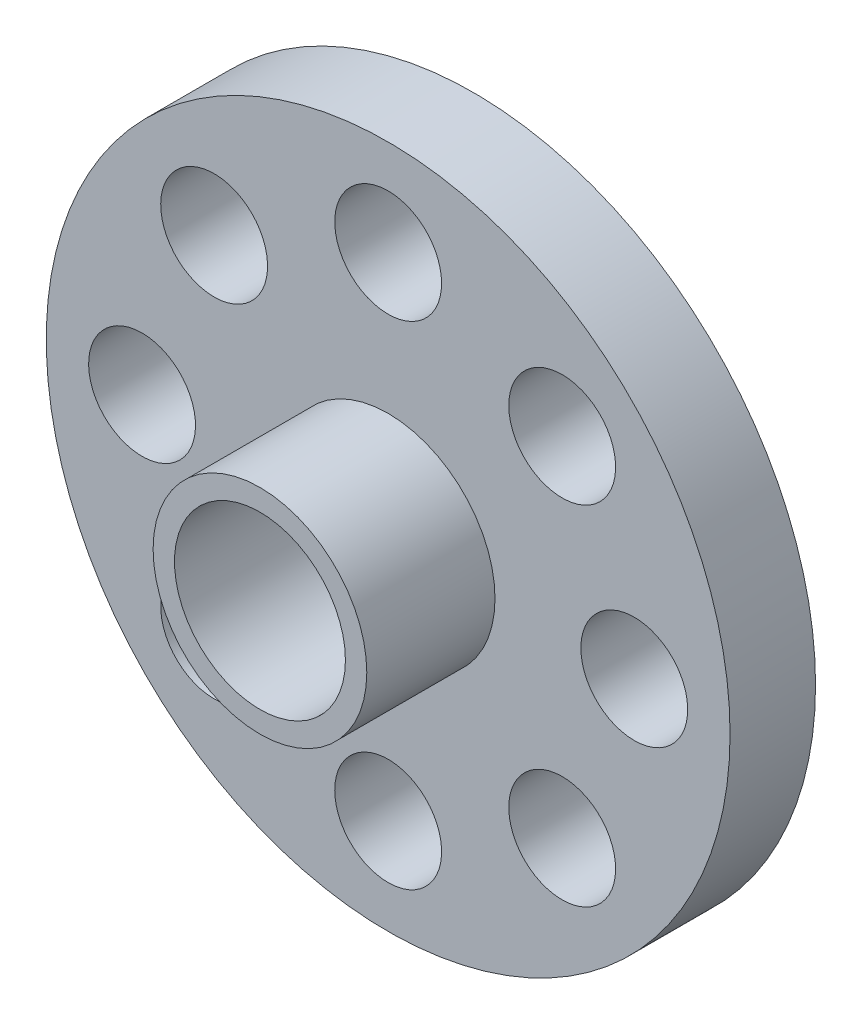
ISO-10303-21;
HEADER;
FILE_DESCRIPTION(('STEP AP214'),'2;1');
FILE_NAME('part.step','',(''),(''),'','','');
FILE_SCHEMA(('AUTOMOTIVE_DESIGN { 1 0 10303 214 1 1 1 1 }'));
ENDSEC;
DATA;
#1=APPLICATION_CONTEXT('core data for automotive mechanical design processes');
#2=APPLICATION_PROTOCOL_DEFINITION('international standard','automotive_design',2000,#1);
#3=PRODUCT_CONTEXT('',#1,'mechanical');
#4=PRODUCT('Part','Part','',(#3));
#5=PRODUCT_RELATED_PRODUCT_CATEGORY('part','',(#4));
#6=PRODUCT_DEFINITION_FORMATION('','',#4);
#7=PRODUCT_DEFINITION_CONTEXT('part definition',#1,'design');
#8=PRODUCT_DEFINITION('design','',#6,#7);
#9=PRODUCT_DEFINITION_SHAPE('','',#8);
#10=(LENGTH_UNIT() NAMED_UNIT(*) SI_UNIT(.MILLI.,.METRE.));
#11=(NAMED_UNIT(*) PLANE_ANGLE_UNIT() SI_UNIT($,.RADIAN.));
#12=(NAMED_UNIT(*) SI_UNIT($,.STERADIAN.) SOLID_ANGLE_UNIT());
#13=UNCERTAINTY_MEASURE_WITH_UNIT(LENGTH_MEASURE(1.E-05),#10,'distance_accuracy_value','');
#14=(GEOMETRIC_REPRESENTATION_CONTEXT(3) GLOBAL_UNCERTAINTY_ASSIGNED_CONTEXT((#13)) GLOBAL_UNIT_ASSIGNED_CONTEXT((#10,
#11,#12)) REPRESENTATION_CONTEXT('',''));
#15=CARTESIAN_POINT('',(0.,0.,0.));
#16=DIRECTION('',(0.,0.,1.));
#17=DIRECTION('',(1.,0.,0.));
#18=AXIS2_PLACEMENT_3D('',#15,#16,#17);
#19=CARTESIAN_POINT('',(0.,0.,10.));
#20=DIRECTION('',(0.,0.,1.));
#21=DIRECTION('',(1.,0.,0.));
#22=AXIS2_PLACEMENT_3D('',#19,#20,#21);
#23=PLANE('',#22);
#24=CARTESIAN_POINT('',(0.,0.,10.));
#25=DIRECTION('',(0.,0.,1.));
#26=DIRECTION('',(1.,0.,0.));
#27=AXIS2_PLACEMENT_3D('',#24,#25,#26);
#28=CIRCLE('',#27,4.);
#29=CARTESIAN_POINT('',(4.,0.,10.));
#30=VERTEX_POINT('',#29);
#31=EDGE_CURVE('E40',#30,#30,#28,.T.);
#32=ORIENTED_EDGE('',*,*,#31,.F.);
#33=EDGE_LOOP('',(#32));
#34=FACE_BOUND('',#33,.T.);
#35=CARTESIAN_POINT('',(0.,0.,10.));
#36=DIRECTION('',(0.,0.,1.));
#37=DIRECTION('',(1.,0.,0.));
#38=AXIS2_PLACEMENT_3D('',#35,#36,#37);
#39=CIRCLE('',#38,5.);
#40=CARTESIAN_POINT('',(5.,0.,10.));
#41=VERTEX_POINT('',#40);
#42=EDGE_CURVE('E54',#41,#41,#39,.T.);
#43=ORIENTED_EDGE('',*,*,#42,.T.);
#44=EDGE_LOOP('',(#43));
#45=FACE_BOUND('',#44,.T.);
#46=ADVANCED_FACE('F33',(#34,#45),#23,.T.);
#47=CARTESIAN_POINT('',(0.,0.,10.));
#48=DIRECTION('',(0.,0.,-1.));
#49=DIRECTION('',(-1.,0.,0.));
#50=AXIS2_PLACEMENT_3D('',#47,#48,#49);
#51=CYLINDRICAL_SURFACE('',#50,16.);
#52=CARTESIAN_POINT('',(0.,0.,0.));
#53=DIRECTION('',(0.,0.,1.));
#54=DIRECTION('',(1.,0.,0.));
#55=AXIS2_PLACEMENT_3D('',#52,#53,#54);
#56=CIRCLE('',#55,16.);
#57=CARTESIAN_POINT('',(16.,0.,0.));
#58=VERTEX_POINT('',#57);
#59=EDGE_CURVE('E10',#58,#58,#56,.T.);
#60=ORIENTED_EDGE('',*,*,#59,.T.);
#61=EDGE_LOOP('',(#60));
#62=FACE_BOUND('',#61,.T.);
#63=CARTESIAN_POINT('',(0.,0.,4.));
#64=DIRECTION('',(0.,0.,1.));
#65=DIRECTION('',(1.,0.,0.));
#66=AXIS2_PLACEMENT_3D('',#63,#64,#65);
#67=CIRCLE('',#66,16.);
#68=CARTESIAN_POINT('',(16.,0.,4.));
#69=VERTEX_POINT('',#68);
#70=EDGE_CURVE('E49',#69,#69,#67,.T.);
#71=ORIENTED_EDGE('',*,*,#70,.F.);
#72=EDGE_LOOP('',(#71));
#73=FACE_BOUND('',#72,.T.);
#74=ADVANCED_FACE('F35',(#62,#73),#51,.T.);
#75=CARTESIAN_POINT('',(0.,0.,0.));
#76=DIRECTION('',(0.,0.,1.));
#77=DIRECTION('',(1.,0.,0.));
#78=AXIS2_PLACEMENT_3D('',#75,#76,#77);
#79=PLANE('',#78);
#80=CARTESIAN_POINT('',(-8.14364214170185,8.14364214170205,0.));
#81=DIRECTION('',(0.,0.,1.));
#82=DIRECTION('',(0.707106781186556,0.707106781186539,0.));
#83=AXIS2_PLACEMENT_3D('',#80,#81,#82);
#84=CIRCLE('',#83,2.5);
#85=CARTESIAN_POINT('',(-6.37587518873546,9.9114090946684,0.));
#86=VERTEX_POINT('',#85);
#87=EDGE_CURVE('E104',#86,#86,#84,.T.);
#88=ORIENTED_EDGE('',*,*,#87,.T.);
#89=EDGE_LOOP('',(#88));
#90=FACE_BOUND('',#89,.T.);
#91=CARTESIAN_POINT('',(-11.516849163908,1.20632591814168E-13,0.));
#92=DIRECTION('',(0.,0.,1.));
#93=DIRECTION('',(0.,1.,0.));
#94=AXIS2_PLACEMENT_3D('',#91,#92,#93);
#95=CIRCLE('',#94,2.5);
#96=CARTESIAN_POINT('',(-11.516849163908,2.50000000000012,0.));
#97=VERTEX_POINT('',#96);
#98=EDGE_CURVE('E98',#97,#97,#95,.T.);
#99=ORIENTED_EDGE('',*,*,#98,.T.);
#100=EDGE_LOOP('',(#99));
#101=FACE_BOUND('',#100,.T.);
#102=CARTESIAN_POINT('',(-8.14364214170202,-8.14364214170188,0.));
#103=DIRECTION('',(0.,0.,1.));
#104=DIRECTION('',(-0.707106781186541,0.707106781186554,0.));
#105=AXIS2_PLACEMENT_3D('',#102,#103,#104);
#106=CIRCLE('',#105,2.5);
#107=CARTESIAN_POINT('',(-9.91140909466838,-6.3758751887355,0.));
#108=VERTEX_POINT('',#107);
#109=EDGE_CURVE('E92',#108,#108,#106,.T.);
#110=ORIENTED_EDGE('',*,*,#109,.T.);
#111=EDGE_LOOP('',(#110));
#112=FACE_BOUND('',#111,.T.);
#113=CARTESIAN_POINT('',(0.,-11.516849163908,0.));
#114=DIRECTION('',(0.,0.,1.));
#115=DIRECTION('',(-1.,0.,0.));
#116=AXIS2_PLACEMENT_3D('',#113,#114,#115);
#117=CIRCLE('',#116,2.5);
#118=CARTESIAN_POINT('',(-2.5,-11.516849163908,0.));
#119=VERTEX_POINT('',#118);
#120=EDGE_CURVE('E86',#119,#119,#117,.T.);
#121=ORIENTED_EDGE('',*,*,#120,.T.);
#122=EDGE_LOOP('',(#121));
#123=FACE_BOUND('',#122,.T.);
#124=CARTESIAN_POINT('',(8.14364214170191,-8.143642141702,0.));
#125=DIRECTION('',(0.,0.,1.));
#126=DIRECTION('',(-0.707106781186551,-0.707106781186544,0.));
#127=AXIS2_PLACEMENT_3D('',#124,#125,#126);
#128=CIRCLE('',#127,2.5);
#129=CARTESIAN_POINT('',(6.37587518873553,-9.91140909466836,0.));
#130=VERTEX_POINT('',#129);
#131=EDGE_CURVE('E80',#130,#130,#128,.T.);
#132=ORIENTED_EDGE('',*,*,#131,.T.);
#133=EDGE_LOOP('',(#132));
#134=FACE_BOUND('',#133,.T.);
#135=CARTESIAN_POINT('',(11.516849163908,0.,0.));
#136=DIRECTION('',(0.,0.,1.));
#137=DIRECTION('',(0.,-1.,0.));
#138=AXIS2_PLACEMENT_3D('',#135,#136,#137);
#139=CIRCLE('',#138,2.5);
#140=CARTESIAN_POINT('',(11.516849163908,-2.50000000000004,0.));
#141=VERTEX_POINT('',#140);
#142=EDGE_CURVE('E74',#141,#141,#139,.T.);
#143=ORIENTED_EDGE('',*,*,#142,.T.);
#144=EDGE_LOOP('',(#143));
#145=FACE_BOUND('',#144,.T.);
#146=CARTESIAN_POINT('',(8.14364214170197,8.14364214170194,0.));
#147=DIRECTION('',(0.,0.,1.));
#148=DIRECTION('',(0.707106781186546,-0.707106781186549,0.));
#149=AXIS2_PLACEMENT_3D('',#146,#147,#148);
#150=CIRCLE('',#149,2.5);
#151=CARTESIAN_POINT('',(9.91140909466833,6.37587518873557,0.));
#152=VERTEX_POINT('',#151);
#153=EDGE_CURVE('E68',#152,#152,#150,.T.);
#154=ORIENTED_EDGE('',*,*,#153,.T.);
#155=EDGE_LOOP('',(#154));
#156=FACE_BOUND('',#155,.T.);
#157=CARTESIAN_POINT('',(0.,11.516849163908,0.));
#158=DIRECTION('',(0.,0.,1.));
#159=DIRECTION('',(1.,0.,0.));
#160=AXIS2_PLACEMENT_3D('',#157,#158,#159);
#161=CIRCLE('',#160,2.5);
#162=CARTESIAN_POINT('',(2.5,11.516849163908,0.));
#163=VERTEX_POINT('',#162);
#164=EDGE_CURVE('E57',#163,#163,#161,.T.);
#165=ORIENTED_EDGE('',*,*,#164,.T.);
#166=EDGE_LOOP('',(#165));
#167=FACE_BOUND('',#166,.T.);
#168=ORIENTED_EDGE('',*,*,#59,.F.);
#169=EDGE_LOOP('',(#168));
#170=FACE_BOUND('',#169,.T.);
#171=CARTESIAN_POINT('',(0.,0.,0.));
#172=DIRECTION('',(0.,0.,1.));
#173=DIRECTION('',(1.,0.,0.));
#174=AXIS2_PLACEMENT_3D('',#171,#172,#173);
#175=CIRCLE('',#174,4.);
#176=CARTESIAN_POINT('',(4.,0.,0.));
#177=VERTEX_POINT('',#176);
#178=EDGE_CURVE('E44',#177,#177,#175,.T.);
#179=ORIENTED_EDGE('',*,*,#178,.T.);
#180=EDGE_LOOP('',(#179));
#181=FACE_BOUND('',#180,.T.);
#182=ADVANCED_FACE('F108',(#90,#101,#112,#123,#134,#145,#156,#167,#170,#181),#79,.F.);
#183=CARTESIAN_POINT('',(0.,0.,10.));
#184=DIRECTION('',(0.,0.,-1.));
#185=DIRECTION('',(-1.,0.,0.));
#186=AXIS2_PLACEMENT_3D('',#183,#184,#185);
#187=CYLINDRICAL_SURFACE('',#186,4.);
#188=ORIENTED_EDGE('',*,*,#31,.T.);
#189=EDGE_LOOP('',(#188));
#190=FACE_BOUND('',#189,.T.);
#191=ORIENTED_EDGE('',*,*,#178,.F.);
#192=EDGE_LOOP('',(#191));
#193=FACE_BOUND('',#192,.T.);
#194=ADVANCED_FACE('F122',(#190,#193),#187,.F.);
#195=CARTESIAN_POINT('',(0.,0.,4.));
#196=DIRECTION('',(0.,0.,1.));
#197=DIRECTION('',(1.,0.,0.));
#198=AXIS2_PLACEMENT_3D('',#195,#196,#197);
#199=PLANE('',#198);
#200=CARTESIAN_POINT('',(-8.14364214170185,8.14364214170205,4.));
#201=DIRECTION('',(0.,0.,1.));
#202=DIRECTION('',(0.707106781186556,0.707106781186539,0.));
#203=AXIS2_PLACEMENT_3D('',#200,#201,#202);
#204=CIRCLE('',#203,2.5);
#205=CARTESIAN_POINT('',(-6.37587518873546,9.9114090946684,4.));
#206=VERTEX_POINT('',#205);
#207=EDGE_CURVE('E101',#206,#206,#204,.T.);
#208=ORIENTED_EDGE('',*,*,#207,.F.);
#209=EDGE_LOOP('',(#208));
#210=FACE_BOUND('',#209,.T.);
#211=CARTESIAN_POINT('',(-11.516849163908,1.20632591814168E-13,4.));
#212=DIRECTION('',(0.,0.,1.));
#213=DIRECTION('',(0.,1.,0.));
#214=AXIS2_PLACEMENT_3D('',#211,#212,#213);
#215=CIRCLE('',#214,2.5);
#216=CARTESIAN_POINT('',(-11.516849163908,2.50000000000012,4.));
#217=VERTEX_POINT('',#216);
#218=EDGE_CURVE('E95',#217,#217,#215,.T.);
#219=ORIENTED_EDGE('',*,*,#218,.F.);
#220=EDGE_LOOP('',(#219));
#221=FACE_BOUND('',#220,.T.);
#222=CARTESIAN_POINT('',(-8.14364214170202,-8.14364214170188,4.));
#223=DIRECTION('',(0.,0.,1.));
#224=DIRECTION('',(-0.707106781186541,0.707106781186554,0.));
#225=AXIS2_PLACEMENT_3D('',#222,#223,#224);
#226=CIRCLE('',#225,2.5);
#227=CARTESIAN_POINT('',(-9.91140909466838,-6.3758751887355,4.));
#228=VERTEX_POINT('',#227);
#229=EDGE_CURVE('E89',#228,#228,#226,.T.);
#230=ORIENTED_EDGE('',*,*,#229,.F.);
#231=EDGE_LOOP('',(#230));
#232=FACE_BOUND('',#231,.T.);
#233=CARTESIAN_POINT('',(0.,-11.516849163908,4.));
#234=DIRECTION('',(0.,0.,1.));
#235=DIRECTION('',(-1.,0.,0.));
#236=AXIS2_PLACEMENT_3D('',#233,#234,#235);
#237=CIRCLE('',#236,2.5);
#238=CARTESIAN_POINT('',(-2.5,-11.516849163908,4.));
#239=VERTEX_POINT('',#238);
#240=EDGE_CURVE('E83',#239,#239,#237,.T.);
#241=ORIENTED_EDGE('',*,*,#240,.F.);
#242=EDGE_LOOP('',(#241));
#243=FACE_BOUND('',#242,.T.);
#244=CARTESIAN_POINT('',(8.14364214170191,-8.143642141702,4.));
#245=DIRECTION('',(0.,0.,1.));
#246=DIRECTION('',(-0.707106781186551,-0.707106781186544,0.));
#247=AXIS2_PLACEMENT_3D('',#244,#245,#246);
#248=CIRCLE('',#247,2.5);
#249=CARTESIAN_POINT('',(6.37587518873553,-9.91140909466836,4.));
#250=VERTEX_POINT('',#249);
#251=EDGE_CURVE('E77',#250,#250,#248,.T.);
#252=ORIENTED_EDGE('',*,*,#251,.F.);
#253=EDGE_LOOP('',(#252));
#254=FACE_BOUND('',#253,.T.);
#255=CARTESIAN_POINT('',(11.516849163908,0.,4.));
#256=DIRECTION('',(0.,0.,1.));
#257=DIRECTION('',(0.,-1.,0.));
#258=AXIS2_PLACEMENT_3D('',#255,#256,#257);
#259=CIRCLE('',#258,2.5);
#260=CARTESIAN_POINT('',(11.516849163908,-2.50000000000004,4.));
#261=VERTEX_POINT('',#260);
#262=EDGE_CURVE('E71',#261,#261,#259,.T.);
#263=ORIENTED_EDGE('',*,*,#262,.F.);
#264=EDGE_LOOP('',(#263));
#265=FACE_BOUND('',#264,.T.);
#266=CARTESIAN_POINT('',(8.14364214170197,8.14364214170194,4.));
#267=DIRECTION('',(0.,0.,1.));
#268=DIRECTION('',(0.707106781186546,-0.707106781186549,0.));
#269=AXIS2_PLACEMENT_3D('',#266,#267,#268);
#270=CIRCLE('',#269,2.5);
#271=CARTESIAN_POINT('',(9.91140909466833,6.37587518873557,4.));
#272=VERTEX_POINT('',#271);
#273=EDGE_CURVE('E63',#272,#272,#270,.T.);
#274=ORIENTED_EDGE('',*,*,#273,.F.);
#275=EDGE_LOOP('',(#274));
#276=FACE_BOUND('',#275,.T.);
#277=CARTESIAN_POINT('',(0.,11.516849163908,4.));
#278=DIRECTION('',(0.,0.,1.));
#279=DIRECTION('',(1.,0.,0.));
#280=AXIS2_PLACEMENT_3D('',#277,#278,#279);
#281=CIRCLE('',#280,2.5);
#282=CARTESIAN_POINT('',(2.5,11.516849163908,4.));
#283=VERTEX_POINT('',#282);
#284=EDGE_CURVE('E60',#283,#283,#281,.T.);
#285=ORIENTED_EDGE('',*,*,#284,.F.);
#286=EDGE_LOOP('',(#285));
#287=FACE_BOUND('',#286,.T.);
#288=CARTESIAN_POINT('',(0.,0.,4.));
#289=DIRECTION('',(0.,0.,1.));
#290=DIRECTION('',(1.,0.,0.));
#291=AXIS2_PLACEMENT_3D('',#288,#289,#290);
#292=CIRCLE('',#291,5.);
#293=CARTESIAN_POINT('',(5.,0.,4.));
#294=VERTEX_POINT('',#293);
#295=EDGE_CURVE('E53',#294,#294,#292,.T.);
#296=ORIENTED_EDGE('',*,*,#295,.F.);
#297=EDGE_LOOP('',(#296));
#298=FACE_BOUND('',#297,.T.);
#299=ORIENTED_EDGE('',*,*,#70,.T.);
#300=EDGE_LOOP('',(#299));
#301=FACE_BOUND('',#300,.T.);
#302=ADVANCED_FACE('F118',(#210,#221,#232,#243,#254,#265,#276,#287,#298,#301),#199,.T.);
#303=CARTESIAN_POINT('',(0.,0.,4.));
#304=DIRECTION('',(0.,0.,1.));
#305=DIRECTION('',(1.,0.,0.));
#306=AXIS2_PLACEMENT_3D('',#303,#304,#305);
#307=CYLINDRICAL_SURFACE('',#306,5.);
#308=ORIENTED_EDGE('',*,*,#295,.T.);
#309=EDGE_LOOP('',(#308));
#310=FACE_BOUND('',#309,.T.);
#311=ORIENTED_EDGE('',*,*,#42,.F.);
#312=EDGE_LOOP('',(#311));
#313=FACE_BOUND('',#312,.T.);
#314=ADVANCED_FACE('F121',(#310,#313),#307,.T.);
#315=CARTESIAN_POINT('',(0.,11.516849163908,0.));
#316=DIRECTION('',(0.,0.,1.));
#317=DIRECTION('',(1.,0.,0.));
#318=AXIS2_PLACEMENT_3D('',#315,#316,#317);
#319=CYLINDRICAL_SURFACE('',#318,2.5);
#320=ORIENTED_EDGE('',*,*,#164,.F.);
#321=EDGE_LOOP('',(#320));
#322=FACE_BOUND('',#321,.T.);
#323=ORIENTED_EDGE('',*,*,#284,.T.);
#324=EDGE_LOOP('',(#323));
#325=FACE_BOUND('',#324,.T.);
#326=ADVANCED_FACE('F157',(#322,#325),#319,.F.);
#327=CARTESIAN_POINT('',(8.14364214170197,8.14364214170194,0.));
#328=DIRECTION('',(0.,0.,1.));
#329=DIRECTION('',(0.707106781186546,-0.707106781186549,0.));
#330=AXIS2_PLACEMENT_3D('',#327,#328,#329);
#331=CYLINDRICAL_SURFACE('',#330,2.5);
#332=ORIENTED_EDGE('',*,*,#153,.F.);
#333=EDGE_LOOP('',(#332));
#334=FACE_BOUND('',#333,.T.);
#335=ORIENTED_EDGE('',*,*,#273,.T.);
#336=EDGE_LOOP('',(#335));
#337=FACE_BOUND('',#336,.T.);
#338=ADVANCED_FACE('F161',(#334,#337),#331,.F.);
#339=CARTESIAN_POINT('',(11.516849163908,0.,0.));
#340=DIRECTION('',(0.,0.,1.));
#341=DIRECTION('',(0.,-1.,0.));
#342=AXIS2_PLACEMENT_3D('',#339,#340,#341);
#343=CYLINDRICAL_SURFACE('',#342,2.5);
#344=ORIENTED_EDGE('',*,*,#142,.F.);
#345=EDGE_LOOP('',(#344));
#346=FACE_BOUND('',#345,.T.);
#347=ORIENTED_EDGE('',*,*,#262,.T.);
#348=EDGE_LOOP('',(#347));
#349=FACE_BOUND('',#348,.T.);
#350=ADVANCED_FACE('F165',(#346,#349),#343,.F.);
#351=CARTESIAN_POINT('',(8.14364214170191,-8.143642141702,0.));
#352=DIRECTION('',(0.,0.,1.));
#353=DIRECTION('',(-0.707106781186551,-0.707106781186544,0.));
#354=AXIS2_PLACEMENT_3D('',#351,#352,#353);
#355=CYLINDRICAL_SURFACE('',#354,2.5);
#356=ORIENTED_EDGE('',*,*,#131,.F.);
#357=EDGE_LOOP('',(#356));
#358=FACE_BOUND('',#357,.T.);
#359=ORIENTED_EDGE('',*,*,#251,.T.);
#360=EDGE_LOOP('',(#359));
#361=FACE_BOUND('',#360,.T.);
#362=ADVANCED_FACE('F169',(#358,#361),#355,.F.);
#363=CARTESIAN_POINT('',(0.,-11.516849163908,0.));
#364=DIRECTION('',(0.,0.,1.));
#365=DIRECTION('',(-1.,0.,0.));
#366=AXIS2_PLACEMENT_3D('',#363,#364,#365);
#367=CYLINDRICAL_SURFACE('',#366,2.5);
#368=ORIENTED_EDGE('',*,*,#120,.F.);
#369=EDGE_LOOP('',(#368));
#370=FACE_BOUND('',#369,.T.);
#371=ORIENTED_EDGE('',*,*,#240,.T.);
#372=EDGE_LOOP('',(#371));
#373=FACE_BOUND('',#372,.T.);
#374=ADVANCED_FACE('F173',(#370,#373),#367,.F.);
#375=CARTESIAN_POINT('',(-8.14364214170202,-8.14364214170188,0.));
#376=DIRECTION('',(0.,0.,1.));
#377=DIRECTION('',(-0.707106781186541,0.707106781186554,0.));
#378=AXIS2_PLACEMENT_3D('',#375,#376,#377);
#379=CYLINDRICAL_SURFACE('',#378,2.5);
#380=ORIENTED_EDGE('',*,*,#109,.F.);
#381=EDGE_LOOP('',(#380));
#382=FACE_BOUND('',#381,.T.);
#383=ORIENTED_EDGE('',*,*,#229,.T.);
#384=EDGE_LOOP('',(#383));
#385=FACE_BOUND('',#384,.T.);
#386=ADVANCED_FACE('F177',(#382,#385),#379,.F.);
#387=CARTESIAN_POINT('',(-11.516849163908,1.20632591814168E-13,0.));
#388=DIRECTION('',(0.,0.,1.));
#389=DIRECTION('',(0.,1.,0.));
#390=AXIS2_PLACEMENT_3D('',#387,#388,#389);
#391=CYLINDRICAL_SURFACE('',#390,2.5);
#392=ORIENTED_EDGE('',*,*,#98,.F.);
#393=EDGE_LOOP('',(#392));
#394=FACE_BOUND('',#393,.T.);
#395=ORIENTED_EDGE('',*,*,#218,.T.);
#396=EDGE_LOOP('',(#395));
#397=FACE_BOUND('',#396,.T.);
#398=ADVANCED_FACE('F114',(#394,#397),#391,.F.);
#399=CARTESIAN_POINT('',(-8.14364214170185,8.14364214170205,0.));
#400=DIRECTION('',(0.,0.,1.));
#401=DIRECTION('',(0.707106781186556,0.707106781186539,0.));
#402=AXIS2_PLACEMENT_3D('',#399,#400,#401);
#403=CYLINDRICAL_SURFACE('',#402,2.5);
#404=ORIENTED_EDGE('',*,*,#87,.F.);
#405=EDGE_LOOP('',(#404));
#406=FACE_BOUND('',#405,.T.);
#407=ORIENTED_EDGE('',*,*,#207,.T.);
#408=EDGE_LOOP('',(#407));
#409=FACE_BOUND('',#408,.T.);
#410=ADVANCED_FACE('F111',(#406,#409),#403,.F.);
#411=CLOSED_SHELL('',(#46,#74,#182,#194,#302,#314,#326,#338,#350,#362,#374,#386,#398,#410));
#412=MANIFOLD_SOLID_BREP('B2',#411);
#413=ADVANCED_BREP_SHAPE_REPRESENTATION('',(#18,#412),#14);
#414=SHAPE_DEFINITION_REPRESENTATION(#9,#413);
ENDSEC;
END-ISO-10303-21;
